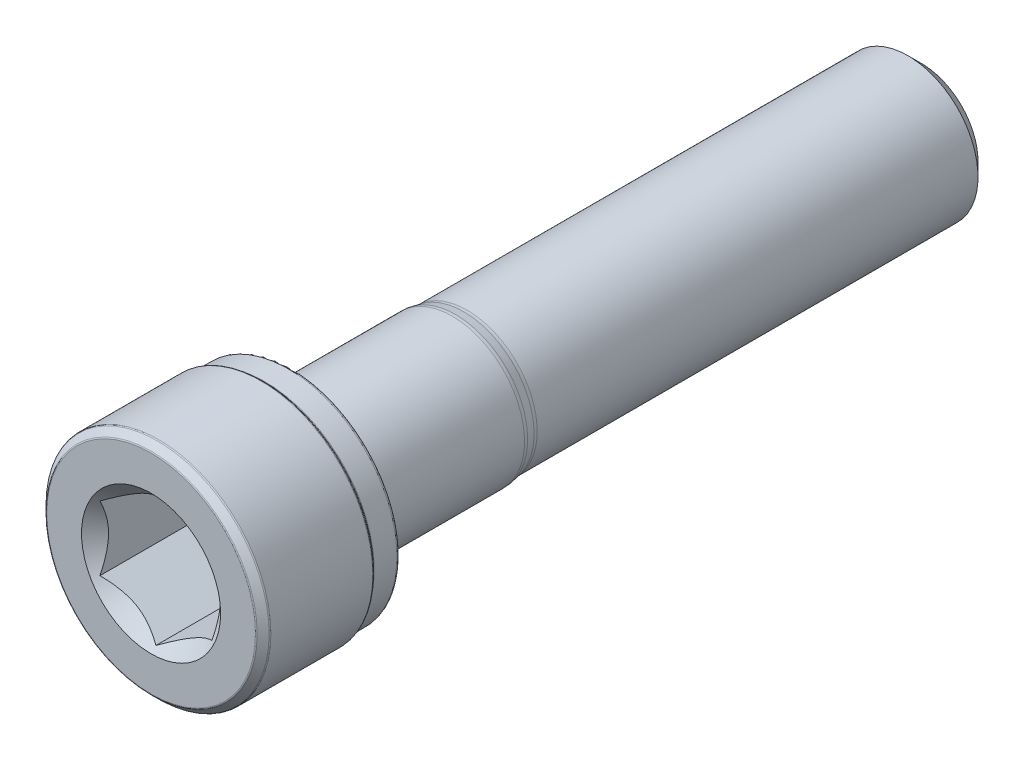
ISO-10303-21;
HEADER;
FILE_DESCRIPTION(('STEP AP214'),'2;1');
FILE_NAME('part.step','',(''),(''),'','','');
FILE_SCHEMA(('AUTOMOTIVE_DESIGN { 1 0 10303 214 1 1 1 1 }'));
ENDSEC;
DATA;
#1=APPLICATION_CONTEXT('core data for automotive mechanical design processes');
#2=APPLICATION_PROTOCOL_DEFINITION('international standard','automotive_design',2000,#1);
#3=PRODUCT_CONTEXT('',#1,'mechanical');
#4=PRODUCT('Part','Part','',(#3));
#5=PRODUCT_RELATED_PRODUCT_CATEGORY('part','',(#4));
#6=PRODUCT_DEFINITION_FORMATION('','',#4);
#7=PRODUCT_DEFINITION_CONTEXT('part definition',#1,'design');
#8=PRODUCT_DEFINITION('design','',#6,#7);
#9=PRODUCT_DEFINITION_SHAPE('','',#8);
#10=(LENGTH_UNIT() NAMED_UNIT(*) SI_UNIT(.MILLI.,.METRE.));
#11=(NAMED_UNIT(*) PLANE_ANGLE_UNIT() SI_UNIT($,.RADIAN.));
#12=(NAMED_UNIT(*) SI_UNIT($,.STERADIAN.) SOLID_ANGLE_UNIT());
#13=UNCERTAINTY_MEASURE_WITH_UNIT(LENGTH_MEASURE(1.E-05),#10,'distance_accuracy_value','');
#14=(GEOMETRIC_REPRESENTATION_CONTEXT(3) GLOBAL_UNCERTAINTY_ASSIGNED_CONTEXT((#13)) GLOBAL_UNIT_ASSIGNED_CONTEXT((#10,
#11,#12)) REPRESENTATION_CONTEXT('',''));
#15=CARTESIAN_POINT('',(0.,0.,0.));
#16=DIRECTION('',(0.,0.,1.));
#17=DIRECTION('',(1.,0.,0.));
#18=AXIS2_PLACEMENT_3D('',#15,#16,#17);
#19=CARTESIAN_POINT('',(0.,4.0257214207425,-27.5));
#20=DIRECTION('',(0.,0.,-1.));
#21=DIRECTION('',(-1.,0.,0.));
#22=AXIS2_PLACEMENT_3D('',#19,#20,#21);
#23=PLANE('',#22);
#24=CARTESIAN_POINT('',(0.,0.,-27.5));
#25=DIRECTION('',(0.,0.,-1.));
#26=DIRECTION('',(-1.,0.,0.));
#27=AXIS2_PLACEMENT_3D('',#24,#25,#26);
#28=CIRCLE('',#27,4.0257214207425);
#29=CARTESIAN_POINT('',(-4.0257214207425,0.,-27.5));
#30=VERTEX_POINT('',#29);
#31=EDGE_CURVE('E49',#30,#30,#28,.T.);
#32=ORIENTED_EDGE('',*,*,#31,.T.);
#33=EDGE_LOOP('',(#32));
#34=FACE_BOUND('',#33,.T.);
#35=ADVANCED_FACE('F36',(#34),#23,.T.);
#36=CARTESIAN_POINT('',(0.,0.,-27.5));
#37=DIRECTION('',(0.,0.,1.));
#38=DIRECTION('',(1.,0.,0.));
#39=AXIS2_PLACEMENT_3D('',#36,#37,#38);
#40=CONICAL_SURFACE('',#39,4.0257214207425,0.785398163397443);
#41=CARTESIAN_POINT('',(0.,0.,-26.5257214207425));
#42=DIRECTION('',(0.,0.,-1.));
#43=DIRECTION('',(-1.,0.,0.));
#44=AXIS2_PLACEMENT_3D('',#41,#42,#43);
#45=CIRCLE('',#44,5.);
#46=CARTESIAN_POINT('',(-5.,0.,-26.5257214207425));
#47=VERTEX_POINT('',#46);
#48=EDGE_CURVE('E182',#47,#47,#45,.T.);
#49=ORIENTED_EDGE('',*,*,#48,.T.);
#50=EDGE_LOOP('',(#49));
#51=FACE_BOUND('',#50,.T.);
#52=ORIENTED_EDGE('',*,*,#31,.F.);
#53=EDGE_LOOP('',(#52));
#54=FACE_BOUND('',#53,.T.);
#55=ADVANCED_FACE('F188',(#51,#54),#40,.T.);
#56=CARTESIAN_POINT('',(0.,0.,-27.5));
#57=DIRECTION('',(0.,0.,-1.));
#58=DIRECTION('',(-1.,0.,0.));
#59=AXIS2_PLACEMENT_3D('',#56,#57,#58);
#60=CYLINDRICAL_SURFACE('',#59,5.);
#61=CARTESIAN_POINT('',(0.,0.,4.93938574580355));
#62=DIRECTION('',(0.,0.,-1.));
#63=DIRECTION('',(-1.,0.,0.));
#64=AXIS2_PLACEMENT_3D('',#61,#62,#63);
#65=CIRCLE('',#64,5.);
#66=CARTESIAN_POINT('',(-5.,0.,4.93938574580355));
#67=VERTEX_POINT('',#66);
#68=EDGE_CURVE('E179',#67,#67,#65,.T.);
#69=ORIENTED_EDGE('',*,*,#68,.T.);
#70=EDGE_LOOP('',(#69));
#71=FACE_BOUND('',#70,.T.);
#72=ORIENTED_EDGE('',*,*,#48,.F.);
#73=EDGE_LOOP('',(#72));
#74=FACE_BOUND('',#73,.T.);
#75=ADVANCED_FACE('F190',(#71,#74),#60,.T.);
#76=CARTESIAN_POINT('',(0.,0.,4.93938574580355));
#77=DIRECTION('',(0.,0.,-1.));
#78=DIRECTION('',(-1.,0.,0.));
#79=AXIS2_PLACEMENT_3D('',#76,#77,#78);
#80=TOROIDAL_SURFACE('',#79,6.25,1.25);
#81=CARTESIAN_POINT('',(0.,0.,5.18324864832371));
#82=DIRECTION('',(0.,0.,-1.));
#83=DIRECTION('',(-1.,0.,0.));
#84=AXIS2_PLACEMENT_3D('',#81,#82,#83);
#85=CIRCLE('',#84,5.02401839949596);
#86=CARTESIAN_POINT('',(-5.02401839949596,0.,5.18324864832371));
#87=VERTEX_POINT('',#86);
#88=EDGE_CURVE('E176',#87,#87,#85,.T.);
#89=ORIENTED_EDGE('',*,*,#88,.T.);
#90=EDGE_LOOP('',(#89));
#91=FACE_BOUND('',#90,.T.);
#92=ORIENTED_EDGE('',*,*,#68,.F.);
#93=EDGE_LOOP('',(#92));
#94=FACE_BOUND('',#93,.T.);
#95=ADVANCED_FACE('F196',(#91,#94),#80,.F.);
#96=CARTESIAN_POINT('',(0.,0.,5.18324864832371));
#97=DIRECTION('',(0.,0.,1.));
#98=DIRECTION('',(1.,0.,0.));
#99=AXIS2_PLACEMENT_3D('',#96,#97,#98);
#100=CONICAL_SURFACE('',#99,5.02401839949596,0.196349540849362);
#101=CARTESIAN_POINT('',(0.,0.,5.75808954798184));
#102=DIRECTION('',(0.,0.,-1.));
#103=DIRECTION('',(-1.,0.,0.));
#104=AXIS2_PLACEMENT_3D('',#101,#102,#103);
#105=CIRCLE('',#104,5.13836136371362);
#106=CARTESIAN_POINT('',(-5.13836136371362,0.,5.75808954798184));
#107=VERTEX_POINT('',#106);
#108=EDGE_CURVE('E173',#107,#107,#105,.T.);
#109=ORIENTED_EDGE('',*,*,#108,.T.);
#110=EDGE_LOOP('',(#109));
#111=FACE_BOUND('',#110,.T.);
#112=ORIENTED_EDGE('',*,*,#88,.F.);
#113=EDGE_LOOP('',(#112));
#114=FACE_BOUND('',#113,.T.);
#115=ADVANCED_FACE('F202',(#111,#114),#100,.T.);
#116=CARTESIAN_POINT('',(0.,0.,6.00195245050201));
#117=DIRECTION('',(0.,0.,-1.));
#118=DIRECTION('',(-1.,0.,0.));
#119=AXIS2_PLACEMENT_3D('',#116,#117,#118);
#120=TOROIDAL_SURFACE('',#119,3.91237976320958,1.25);
#121=CARTESIAN_POINT('',(0.,0.,6.001952450502));
#122=DIRECTION('',(0.,0.,-1.));
#123=DIRECTION('',(-1.,0.,0.));
#124=AXIS2_PLACEMENT_3D('',#121,#122,#123);
#125=CIRCLE('',#124,5.16237976320958);
#126=CARTESIAN_POINT('',(-5.16237976320958,0.,6.001952450502));
#127=VERTEX_POINT('',#126);
#128=EDGE_CURVE('E170',#127,#127,#125,.T.);
#129=ORIENTED_EDGE('',*,*,#128,.T.);
#130=EDGE_LOOP('',(#129));
#131=FACE_BOUND('',#130,.T.);
#132=ORIENTED_EDGE('',*,*,#108,.F.);
#133=EDGE_LOOP('',(#132));
#134=FACE_BOUND('',#133,.T.);
#135=ADVANCED_FACE('F206',(#131,#134),#120,.T.);
#136=CARTESIAN_POINT('',(0.,0.,-27.5));
#137=DIRECTION('',(0.,0.,-1.));
#138=DIRECTION('',(-1.,0.,0.));
#139=AXIS2_PLACEMENT_3D('',#136,#137,#138);
#140=CYLINDRICAL_SURFACE('',#139,5.16237976320958);
#141=CARTESIAN_POINT('',(0.,0.,17.));
#142=DIRECTION('',(0.,0.,-1.));
#143=DIRECTION('',(-1.,0.,0.));
#144=AXIS2_PLACEMENT_3D('',#141,#142,#143);
#145=CIRCLE('',#144,5.16237976320958);
#146=CARTESIAN_POINT('',(-5.16237976320958,0.,17.));
#147=VERTEX_POINT('',#146);
#148=EDGE_CURVE('E167',#147,#147,#145,.T.);
#149=ORIENTED_EDGE('',*,*,#148,.T.);
#150=EDGE_LOOP('',(#149));
#151=FACE_BOUND('',#150,.T.);
#152=ORIENTED_EDGE('',*,*,#128,.F.);
#153=EDGE_LOOP('',(#152));
#154=FACE_BOUND('',#153,.T.);
#155=ADVANCED_FACE('F210',(#151,#154),#140,.T.);
#156=CARTESIAN_POINT('',(0.,0.,17.));
#157=DIRECTION('',(0.,0.,-1.));
#158=DIRECTION('',(-1.,0.,0.));
#159=AXIS2_PLACEMENT_3D('',#156,#157,#158);
#160=TOROIDAL_SURFACE('',#159,5.66237976320958,0.499999999999997);
#161=CARTESIAN_POINT('',(0.,0.,17.5));
#162=DIRECTION('',(0.,0.,-1.));
#163=DIRECTION('',(-1.,0.,0.));
#164=AXIS2_PLACEMENT_3D('',#161,#162,#163);
#165=CIRCLE('',#164,5.66237976320958);
#166=CARTESIAN_POINT('',(-5.66237976320958,0.,17.5));
#167=VERTEX_POINT('',#166);
#168=EDGE_CURVE('E164',#167,#167,#165,.T.);
#169=ORIENTED_EDGE('',*,*,#168,.T.);
#170=EDGE_LOOP('',(#169));
#171=FACE_BOUND('',#170,.T.);
#172=ORIENTED_EDGE('',*,*,#148,.F.);
#173=EDGE_LOOP('',(#172));
#174=FACE_BOUND('',#173,.T.);
#175=ADVANCED_FACE('F214',(#171,#174),#160,.F.);
#176=CARTESIAN_POINT('',(0.,7.55,17.5));
#177=DIRECTION('',(0.,0.,-1.));
#178=DIRECTION('',(-1.,0.,0.));
#179=AXIS2_PLACEMENT_3D('',#176,#177,#178);
#180=PLANE('',#179);
#181=CARTESIAN_POINT('',(0.,0.,17.5));
#182=DIRECTION('',(0.,0.,-1.));
#183=DIRECTION('',(-1.,0.,0.));
#184=AXIS2_PLACEMENT_3D('',#181,#182,#183);
#185=CIRCLE('',#184,7.55);
#186=CARTESIAN_POINT('',(-7.55,0.,17.5));
#187=VERTEX_POINT('',#186);
#188=EDGE_CURVE('E161',#187,#187,#185,.T.);
#189=ORIENTED_EDGE('',*,*,#188,.T.);
#190=EDGE_LOOP('',(#189));
#191=FACE_BOUND('',#190,.T.);
#192=ORIENTED_EDGE('',*,*,#168,.F.);
#193=EDGE_LOOP('',(#192));
#194=FACE_BOUND('',#193,.T.);
#195=ADVANCED_FACE('F218',(#191,#194),#180,.T.);
#196=CARTESIAN_POINT('',(0.,0.,17.7));
#197=DIRECTION('',(0.,0.,-1.));
#198=DIRECTION('',(-1.,0.,0.));
#199=AXIS2_PLACEMENT_3D('',#196,#197,#198);
#200=TOROIDAL_SURFACE('',#199,7.55,0.199999999999999);
#201=CARTESIAN_POINT('',(0.,0.,17.7));
#202=DIRECTION('',(0.,0.,-1.));
#203=DIRECTION('',(-1.,0.,0.));
#204=AXIS2_PLACEMENT_3D('',#201,#202,#203);
#205=CIRCLE('',#204,7.75);
#206=CARTESIAN_POINT('',(-7.75,0.,17.7));
#207=VERTEX_POINT('',#206);
#208=EDGE_CURVE('E158',#207,#207,#205,.T.);
#209=ORIENTED_EDGE('',*,*,#208,.T.);
#210=EDGE_LOOP('',(#209));
#211=FACE_BOUND('',#210,.T.);
#212=ORIENTED_EDGE('',*,*,#188,.F.);
#213=EDGE_LOOP('',(#212));
#214=FACE_BOUND('',#213,.T.);
#215=ADVANCED_FACE('F222',(#211,#214),#200,.T.);
#216=CARTESIAN_POINT('',(0.,0.,-27.5));
#217=DIRECTION('',(0.,0.,-1.));
#218=DIRECTION('',(-1.,0.,0.));
#219=AXIS2_PLACEMENT_3D('',#216,#217,#218);
#220=CYLINDRICAL_SURFACE('',#219,7.75);
#221=CARTESIAN_POINT('',(0.,0.,19.3232233047034));
#222=DIRECTION('',(0.,0.,-1.));
#223=DIRECTION('',(-1.,0.,0.));
#224=AXIS2_PLACEMENT_3D('',#221,#222,#223);
#225=CIRCLE('',#224,7.75);
#226=CARTESIAN_POINT('',(-7.75,0.,19.3232233047034));
#227=VERTEX_POINT('',#226);
#228=EDGE_CURVE('E155',#227,#227,#225,.T.);
#229=ORIENTED_EDGE('',*,*,#228,.T.);
#230=EDGE_LOOP('',(#229));
#231=FACE_BOUND('',#230,.T.);
#232=ORIENTED_EDGE('',*,*,#208,.F.);
#233=EDGE_LOOP('',(#232));
#234=FACE_BOUND('',#233,.T.);
#235=ADVANCED_FACE('F226',(#231,#234),#220,.T.);
#236=CARTESIAN_POINT('',(0.,0.,19.3232233047034));
#237=DIRECTION('',(0.,0.,-1.));
#238=DIRECTION('',(-1.,0.,0.));
#239=AXIS2_PLACEMENT_3D('',#236,#237,#238);
#240=TOROIDAL_SURFACE('',#239,7.875,0.125000000000001);
#241=CARTESIAN_POINT('',(0.,0.,19.4116116523517));
#242=DIRECTION('',(0.,0.,-1.));
#243=DIRECTION('',(-1.,0.,0.));
#244=AXIS2_PLACEMENT_3D('',#241,#242,#243);
#245=CIRCLE('',#244,7.78661165235168);
#246=CARTESIAN_POINT('',(-7.78661165235168,0.,19.4116116523517));
#247=VERTEX_POINT('',#246);
#248=EDGE_CURVE('E152',#247,#247,#245,.T.);
#249=ORIENTED_EDGE('',*,*,#248,.T.);
#250=EDGE_LOOP('',(#249));
#251=FACE_BOUND('',#250,.T.);
#252=ORIENTED_EDGE('',*,*,#228,.F.);
#253=EDGE_LOOP('',(#252));
#254=FACE_BOUND('',#253,.T.);
#255=ADVANCED_FACE('F230',(#251,#254),#240,.F.);
#256=CARTESIAN_POINT('',(0.,0.,19.4116116523517));
#257=DIRECTION('',(0.,0.,1.));
#258=DIRECTION('',(1.,0.,0.));
#259=AXIS2_PLACEMENT_3D('',#256,#257,#258);
#260=CONICAL_SURFACE('',#259,7.78661165235168,0.785398163397461);
#261=CARTESIAN_POINT('',(0.,0.,19.5883883476483));
#262=DIRECTION('',(0.,0.,-1.));
#263=DIRECTION('',(-1.,0.,0.));
#264=AXIS2_PLACEMENT_3D('',#261,#262,#263);
#265=CIRCLE('',#264,7.96338834764832);
#266=CARTESIAN_POINT('',(-7.96338834764832,0.,19.5883883476483));
#267=VERTEX_POINT('',#266);
#268=EDGE_CURVE('E149',#267,#267,#265,.T.);
#269=ORIENTED_EDGE('',*,*,#268,.T.);
#270=EDGE_LOOP('',(#269));
#271=FACE_BOUND('',#270,.T.);
#272=ORIENTED_EDGE('',*,*,#248,.F.);
#273=EDGE_LOOP('',(#272));
#274=FACE_BOUND('',#273,.T.);
#275=ADVANCED_FACE('F234',(#271,#274),#260,.T.);
#276=CARTESIAN_POINT('',(0.,0.,19.6767766952966));
#277=DIRECTION('',(0.,0.,-1.));
#278=DIRECTION('',(-1.,0.,0.));
#279=AXIS2_PLACEMENT_3D('',#276,#277,#278);
#280=TOROIDAL_SURFACE('',#279,7.875,0.125000000000001);
#281=CARTESIAN_POINT('',(0.,0.,19.6767766952966));
#282=DIRECTION('',(0.,0.,-1.));
#283=DIRECTION('',(-1.,0.,0.));
#284=AXIS2_PLACEMENT_3D('',#281,#282,#283);
#285=CIRCLE('',#284,8.);
#286=CARTESIAN_POINT('',(-8.,0.,19.6767766952966));
#287=VERTEX_POINT('',#286);
#288=EDGE_CURVE('E146',#287,#287,#285,.T.);
#289=ORIENTED_EDGE('',*,*,#288,.T.);
#290=EDGE_LOOP('',(#289));
#291=FACE_BOUND('',#290,.T.);
#292=ORIENTED_EDGE('',*,*,#268,.F.);
#293=EDGE_LOOP('',(#292));
#294=FACE_BOUND('',#293,.T.);
#295=ADVANCED_FACE('F238',(#291,#294),#280,.T.);
#296=CARTESIAN_POINT('',(0.,0.,-27.5));
#297=DIRECTION('',(0.,0.,-1.));
#298=DIRECTION('',(-1.,0.,0.));
#299=AXIS2_PLACEMENT_3D('',#296,#297,#298);
#300=CYLINDRICAL_SURFACE('',#299,8.);
#301=CARTESIAN_POINT('',(0.,0.,26.9482233047034));
#302=DIRECTION('',(0.,0.,-1.));
#303=DIRECTION('',(-1.,0.,0.));
#304=AXIS2_PLACEMENT_3D('',#301,#302,#303);
#305=CIRCLE('',#304,8.);
#306=CARTESIAN_POINT('',(-8.,0.,26.9482233047034));
#307=VERTEX_POINT('',#306);
#308=EDGE_CURVE('E143',#307,#307,#305,.T.);
#309=ORIENTED_EDGE('',*,*,#308,.T.);
#310=EDGE_LOOP('',(#309));
#311=FACE_BOUND('',#310,.T.);
#312=ORIENTED_EDGE('',*,*,#288,.F.);
#313=EDGE_LOOP('',(#312));
#314=FACE_BOUND('',#313,.T.);
#315=ADVANCED_FACE('F242',(#311,#314),#300,.T.);
#316=CARTESIAN_POINT('',(0.,0.,26.9482233047034));
#317=DIRECTION('',(0.,0.,-1.));
#318=DIRECTION('',(-1.,0.,0.));
#319=AXIS2_PLACEMENT_3D('',#316,#317,#318);
#320=TOROIDAL_SURFACE('',#319,7.875,0.125000000000002);
#321=CARTESIAN_POINT('',(0.,0.,27.0366116523517));
#322=DIRECTION('',(0.,0.,-1.));
#323=DIRECTION('',(-1.,0.,0.));
#324=AXIS2_PLACEMENT_3D('',#321,#322,#323);
#325=CIRCLE('',#324,7.96338834764832);
#326=CARTESIAN_POINT('',(-7.96338834764832,0.,27.0366116523517));
#327=VERTEX_POINT('',#326);
#328=EDGE_CURVE('E140',#327,#327,#325,.T.);
#329=ORIENTED_EDGE('',*,*,#328,.T.);
#330=EDGE_LOOP('',(#329));
#331=FACE_BOUND('',#330,.T.);
#332=ORIENTED_EDGE('',*,*,#308,.F.);
#333=EDGE_LOOP('',(#332));
#334=FACE_BOUND('',#333,.T.);
#335=ADVANCED_FACE('F246',(#331,#334),#320,.T.);
#336=CARTESIAN_POINT('',(0.,0.,27.0366116523517));
#337=DIRECTION('',(0.,0.,-1.));
#338=DIRECTION('',(-1.,0.,0.));
#339=AXIS2_PLACEMENT_3D('',#336,#337,#338);
#340=CONICAL_SURFACE('',#339,7.96338834764832,0.785398163397458);
#341=CARTESIAN_POINT('',(0.,0.,27.4633883476483));
#342=DIRECTION('',(0.,0.,-1.));
#343=DIRECTION('',(-1.,0.,0.));
#344=AXIS2_PLACEMENT_3D('',#341,#342,#343);
#345=CIRCLE('',#344,7.53661165235168);
#346=CARTESIAN_POINT('',(-7.53661165235168,0.,27.4633883476483));
#347=VERTEX_POINT('',#346);
#348=EDGE_CURVE('E137',#347,#347,#345,.T.);
#349=ORIENTED_EDGE('',*,*,#348,.T.);
#350=EDGE_LOOP('',(#349));
#351=FACE_BOUND('',#350,.T.);
#352=ORIENTED_EDGE('',*,*,#328,.F.);
#353=EDGE_LOOP('',(#352));
#354=FACE_BOUND('',#353,.T.);
#355=ADVANCED_FACE('F250',(#351,#354),#340,.T.);
#356=CARTESIAN_POINT('',(0.,0.,27.375));
#357=DIRECTION('',(0.,0.,-1.));
#358=DIRECTION('',(-1.,0.,0.));
#359=AXIS2_PLACEMENT_3D('',#356,#357,#358);
#360=TOROIDAL_SURFACE('',#359,7.44822330470336,0.125);
#361=CARTESIAN_POINT('',(0.,0.,27.5));
#362=DIRECTION('',(0.,0.,-1.));
#363=DIRECTION('',(-1.,0.,0.));
#364=AXIS2_PLACEMENT_3D('',#361,#362,#363);
#365=CIRCLE('',#364,7.44822330470336);
#366=CARTESIAN_POINT('',(-7.44822330470336,0.,27.5));
#367=VERTEX_POINT('',#366);
#368=EDGE_CURVE('E134',#367,#367,#365,.T.);
#369=ORIENTED_EDGE('',*,*,#368,.T.);
#370=EDGE_LOOP('',(#369));
#371=FACE_BOUND('',#370,.T.);
#372=ORIENTED_EDGE('',*,*,#348,.F.);
#373=EDGE_LOOP('',(#372));
#374=FACE_BOUND('',#373,.T.);
#375=ADVANCED_FACE('F254',(#371,#374),#360,.T.);
#376=CARTESIAN_POINT('',(0.,0.,27.5));
#377=DIRECTION('',(0.,0.,1.));
#378=DIRECTION('',(1.,0.,0.));
#379=AXIS2_PLACEMENT_3D('',#376,#377,#378);
#380=PLANE('',#379);
#381=CARTESIAN_POINT('',(0.,0.,27.5));
#382=DIRECTION('',(0.,0.,1.));
#383=DIRECTION('',(1.,0.,0.));
#384=AXIS2_PLACEMENT_3D('',#381,#382,#383);
#385=CIRCLE('',#384,4.96521231503078);
#386=CARTESIAN_POINT('',(4.96521231503078,0.,27.5));
#387=VERTEX_POINT('',#386);
#388=EDGE_CURVE('E108',#387,#387,#385,.T.);
#389=ORIENTED_EDGE('',*,*,#388,.F.);
#390=EDGE_LOOP('',(#389));
#391=FACE_BOUND('',#390,.T.);
#392=ORIENTED_EDGE('',*,*,#368,.F.);
#393=EDGE_LOOP('',(#392));
#394=FACE_BOUND('',#393,.T.);
#395=ADVANCED_FACE('F258',(#391,#394),#380,.T.);
#396=CARTESIAN_POINT('',(0.,0.,27.5));
#397=DIRECTION('',(0.,0.,1.));
#398=DIRECTION('',(1.,0.,0.));
#399=AXIS2_PLACEMENT_3D('',#396,#397,#398);
#400=CONICAL_SURFACE('',#399,4.96521231503078,0.78539816339745);
#401=ORIENTED_EDGE('',*,*,#388,.T.);
#402=EDGE_LOOP('',(#401));
#403=FACE_BOUND('',#402,.T.);
#404=CARTESIAN_POINT('',(-0.000199999999999184,-4.61891762357084,27.1537053128701));
#405=CARTESIAN_POINT('',(0.0685809847183843,-4.57920690352856,27.1139986944438));
#406=CARTESIAN_POINT('',(0.137888304896503,-4.53919230356691,27.0755102555994));
#407=CARTESIAN_POINT('',(0.277664036763595,-4.45849274714727,27.0013410622217));
#408=CARTESIAN_POINT('',(0.348133057578706,-4.41780743901013,26.9656618412179));
#409=CARTESIAN_POINT('',(0.562100081603905,-4.29427352009148,26.8630907061372));
#410=CARTESIAN_POINT('',(0.707416589267749,-4.21037499527406,26.8011029494988));
#411=CARTESIAN_POINT('',(1.00040214981326,-4.04121970302444,26.6949457074956));
#412=CARTESIAN_POINT('',(1.14799719663765,-3.95600566300932,26.6505088939397));
#413=CARTESIAN_POINT('',(1.44644641508887,-3.78369592639707,26.5820388206157));
#414=CARTESIAN_POINT('',(1.59729144640344,-3.69660550696169,26.5579544763475));
#415=CARTESIAN_POINT('',(1.85726690511357,-3.5465086058927,26.5362247193468));
#416=CARTESIAN_POINT('',(1.96606238220553,-3.48369550790704,26.5330087531271));
#417=CARTESIAN_POINT('',(2.18347675426334,-3.35817126167378,26.5384298967112));
#418=CARTESIAN_POINT('',(2.29209557396636,-3.29546015687917,26.547071161658));
#419=CARTESIAN_POINT('',(2.50830402737816,-3.1706321481008,26.5757138769827));
#420=CARTESIAN_POINT('',(2.61589237292034,-3.10851598784036,26.5957280330375));
#421=CARTESIAN_POINT('',(2.82922129322135,-2.98535047827863,26.6460239958509));
#422=CARTESIAN_POINT('',(2.93496200899965,-2.92430104755973,26.6763050153646));
#423=CARTESIAN_POINT('',(3.12267722089177,-2.81592361944283,26.7386050911804));
#424=CARTESIAN_POINT('',(3.20506731843131,-2.76835567444981,26.7689861183463));
#425=CARTESIAN_POINT('',(3.3683684620413,-2.67407371522761,26.8346443030466));
#426=CARTESIAN_POINT('',(3.44927946303277,-2.62735972702479,26.869921609526));
#427=CARTESIAN_POINT('',(3.60936749601014,-2.53493285809126,26.9445815255071));
#428=CARTESIAN_POINT('',(3.68854908118624,-2.48921734857498,26.9839512254898));
#429=CARTESIAN_POINT('',(3.84544590098815,-2.39863292742735,27.0662789466295));
#430=CARTESIAN_POINT('',(3.92316199986077,-2.35376351682288,27.1092347662882));
#431=CARTESIAN_POINT('',(4.0002,-2.30928560670466,27.1537053128701));
#432=B_SPLINE_CURVE_WITH_KNOTS('',3,(#404,#405,#406,#407,#408,#409,#410,#411,#412,#413,#414,
#415,#416,#417,#418,#419,#420,#421,#422,#423,#424,#425,#426,#427,#428,#429,#430,#431),
.UNSPECIFIED.,.F.,.F.,(4,2,2,2,2,2,2,2,2,2,2,2,2,4),(0.,0.266361961703665,0.532868334400113,
1.06875865685462,1.59613884594051,2.12219135055581,2.49866160599659,2.87526382203495,
3.25228760372077,3.62928248242858,3.92874944437161,4.22822551811345,4.52678401907573,
4.82516056577922),.UNSPECIFIED.);
#433=CARTESIAN_POINT('',(0.,-4.618802153517,27.1535898384862));
#434=VERTEX_POINT('',#433);
#435=CARTESIAN_POINT('',(4.,-2.3094010767585,27.1535898384862));
#436=VERTEX_POINT('',#435);
#437=EDGE_CURVE('E13',#434,#436,#432,.T.);
#438=ORIENTED_EDGE('',*,*,#437,.F.);
#439=CARTESIAN_POINT('',(-4.0002,-2.30928560670466,27.1537053128701));
#440=CARTESIAN_POINT('',(-3.93141901528161,-2.34899632674695,27.1139986944438));
#441=CARTESIAN_POINT('',(-3.8621116951035,-2.3890109267086,27.0755102555994));
#442=CARTESIAN_POINT('',(-3.7223359632364,-2.46971048312824,27.0013410622217));
#443=CARTESIAN_POINT('',(-3.65186694242129,-2.51039579126538,26.9656618412179));
#444=CARTESIAN_POINT('',(-3.43789991839609,-2.63392971018403,26.8630907061372));
#445=CARTESIAN_POINT('',(-3.29258341073225,-2.71782823500144,26.8011029494988));
#446=CARTESIAN_POINT('',(-2.99959785018674,-2.88698352725107,26.6949457074956));
#447=CARTESIAN_POINT('',(-2.85200280336235,-2.97219756726618,26.6505088939397));
#448=CARTESIAN_POINT('',(-2.55355358491113,-3.14450730387843,26.5820388206157));
#449=CARTESIAN_POINT('',(-2.40270855359656,-3.23159772331381,26.5579544763475));
#450=CARTESIAN_POINT('',(-2.14273309488644,-3.3816946243828,26.5362247193467));
#451=CARTESIAN_POINT('',(-2.03393761779447,-3.44450772236846,26.5330087531271));
#452=CARTESIAN_POINT('',(-1.81652324573667,-3.57003196860173,26.5384298967112));
#453=CARTESIAN_POINT('',(-1.70790442603364,-3.63274307339633,26.547071161658));
#454=CARTESIAN_POINT('',(-1.49169597262184,-3.7575710821747,26.5757138769827));
#455=CARTESIAN_POINT('',(-1.38410762707966,-3.81968724243515,26.5957280330375));
#456=CARTESIAN_POINT('',(-1.17077870677865,-3.94285275199687,26.6460239958509));
#457=CARTESIAN_POINT('',(-1.06503799100035,-4.00390218271577,26.6763050153646));
#458=CARTESIAN_POINT('',(-0.877322779108236,-4.11227961083267,26.7386050911804));
#459=CARTESIAN_POINT('',(-0.794932681568686,-4.15984755582569,26.7689861183463));
#460=CARTESIAN_POINT('',(-0.631631537958703,-4.25412951504789,26.8346443030466));
#461=CARTESIAN_POINT('',(-0.550720536967236,-4.30084350325072,26.869921609526));
#462=CARTESIAN_POINT('',(-0.390632503989867,-4.39327037218424,26.9445815255071));
#463=CARTESIAN_POINT('',(-0.311450918813762,-4.43898588170052,26.9839512254898));
#464=CARTESIAN_POINT('',(-0.154554099011846,-4.52957030284816,27.0662789466295));
#465=CARTESIAN_POINT('',(-0.0768380001392359,-4.57443971345262,27.1092347662882));
#466=CARTESIAN_POINT('',(0.000199999999999298,-4.61891762357084,27.1537053128701));
#467=B_SPLINE_CURVE_WITH_KNOTS('',3,(#439,#440,#441,#442,#443,#444,#445,#446,#447,#448,#449,
#450,#451,#452,#453,#454,#455,#456,#457,#458,#459,#460,#461,#462,#463,#464,#465,#466),
.UNSPECIFIED.,.F.,.F.,(4,2,2,2,2,2,2,2,2,2,2,2,2,4),(0.,0.266361961703663,0.532868334400111,
1.06875865685462,1.59613884594051,2.1221913505558,2.49866160599658,2.87526382203494,
3.25228760372076,3.62928248242857,3.92874944437161,4.22822551811344,4.52678401907573,
4.82516056577921),.UNSPECIFIED.);
#468=CARTESIAN_POINT('',(-4.,-2.3094010767585,27.1535898384862));
#469=VERTEX_POINT('',#468);
#470=EDGE_CURVE('E94',#469,#434,#467,.T.);
#471=ORIENTED_EDGE('',*,*,#470,.F.);
#472=CARTESIAN_POINT('',(-4.,-4.84796351159736,28.8199090210915));
#473=CARTESIAN_POINT('',(-4.,-4.73094775271701,28.7296703519537));
#474=CARTESIAN_POINT('',(-4.,-4.61330473327711,28.6402323513585));
#475=CARTESIAN_POINT('',(-4.,-4.37650663932726,28.463324424178));
#476=CARTESIAN_POINT('',(-4.,-4.25735121633365,28.3758549645429));
#477=CARTESIAN_POINT('',(-4.,-4.01640038536639,28.202628492792));
#478=CARTESIAN_POINT('',(-4.,-3.89459170738759,28.1168898786441));
#479=CARTESIAN_POINT('',(-4.,-3.64895271240305,27.9483692995862));
#480=CARTESIAN_POINT('',(-4.,-3.52512253503683,27.865587131702));
#481=CARTESIAN_POINT('',(-4.,-3.26706602333273,27.6984528333312));
#482=CARTESIAN_POINT('',(-4.,-3.13268291093558,27.6143415566521));
#483=CARTESIAN_POINT('',(-4.,-2.86075911194824,27.45130040367));
#484=CARTESIAN_POINT('',(-4.,-2.72321789522222,27.3723714060017));
#485=CARTESIAN_POINT('',(-4.,-2.44493368555139,27.2213727282298));
#486=CARTESIAN_POINT('',(-4.,-2.30420169961261,27.1492829212728));
#487=CARTESIAN_POINT('',(-4.,-2.01874172826489,27.0135778764669));
#488=CARTESIAN_POINT('',(-4.,-1.87401567716766,26.9499586203861));
#489=CARTESIAN_POINT('',(-4.,-1.59506570153393,26.8393837995044));
#490=CARTESIAN_POINT('',(-4.,-1.46125573687274,26.791394523732));
#491=CARTESIAN_POINT('',(-4.,-1.19020243591671,26.7061242743582));
#492=CARTESIAN_POINT('',(-4.,-1.0529588836101,26.6688439763244));
#493=CARTESIAN_POINT('',(-4.,-0.77826306033359,26.607641052654));
#494=CARTESIAN_POINT('',(-4.,-0.640866189889941,26.5834739691558));
#495=CARTESIAN_POINT('',(-4.,-0.364334338536459,26.5490058458618));
#496=CARTESIAN_POINT('',(-4.,-0.225199733425797,26.5387018587228));
#497=CARTESIAN_POINT('',(-4.,0.0471484323145581,26.5328522686027));
#498=CARTESIAN_POINT('',(-4.,0.180348358873335,26.5366669151268));
#499=CARTESIAN_POINT('',(-4.,0.445721460208563,26.5573687741345));
#500=CARTESIAN_POINT('',(-4.,0.577894541582717,26.5742571620696));
#501=CARTESIAN_POINT('',(-4.,0.842498402684408,26.6204342043486));
#502=CARTESIAN_POINT('',(-4.,0.974890129436142,26.6499428512439));
#503=CARTESIAN_POINT('',(-4.,1.23675344348026,26.7197148848402));
#504=CARTESIAN_POINT('',(-4.,1.36622518545985,26.7599777003772));
#505=CARTESIAN_POINT('',(-4.,1.62882923254182,26.8518636882929));
#506=CARTESIAN_POINT('',(-4.,1.7617873246249,26.9039790323119));
#507=CARTESIAN_POINT('',(-4.,2.02428699372346,27.0162662972943));
#508=CARTESIAN_POINT('',(-4.,2.15382700464209,27.0764418371076));
#509=CARTESIAN_POINT('',(-4.,2.41009996466026,27.2034228472037));
#510=CARTESIAN_POINT('',(-4.,2.53682273673023,27.2702486898914));
#511=CARTESIAN_POINT('',(-4.,2.78736578127709,27.4090604627306));
#512=CARTESIAN_POINT('',(-4.,2.9111864951555,27.4810456013078));
#513=CARTESIAN_POINT('',(-4.,3.15025630477812,27.6255146350887));
#514=CARTESIAN_POINT('',(-4.,3.26562685587696,27.6977986060776));
#515=CARTESIAN_POINT('',(-4.,3.49438568289111,27.8454470624286));
#516=CARTESIAN_POINT('',(-4.,3.60777380947017,27.9208117784483));
#517=CARTESIAN_POINT('',(-4.,3.83191643601812,28.0734599586493));
#518=CARTESIAN_POINT('',(-4.,3.94268476297645,28.1507231928381));
#519=CARTESIAN_POINT('',(-4.,4.16270125868065,28.3073236511593));
#520=CARTESIAN_POINT('',(-4.,4.27194983812314,28.3866602976074));
#521=CARTESIAN_POINT('',(-4.,4.38056079245562,28.4668457474294));
#522=B_SPLINE_CURVE_WITH_KNOTS('',3,(#472,#473,#474,#475,#476,#477,#478,#479,#480,#481,#482,
#483,#484,#485,#486,#487,#488,#489,#490,#491,#492,#493,#494,#495,#496,#497,#498,#499,#500,#501,
#502,#503,#504,#505,#506,#507,#508,#509,#510,#511,#512,#513,#514,#515,#516,#517,#518,#519,#520,
#521),.UNSPECIFIED.,.F.,.F.,(4,2,2,2,2,2,2,2,2,2,2,2,2,2,2,2,2,2,2,2,2,2,2,2,4),(0.,
0.443315334200679,0.886734740254649,1.33357225144677,1.78037902588288,2.25589283704767,
2.73148706259438,3.20563518661489,3.67955757830237,4.10565623427866,4.53178176445625,
4.94966371534264,5.36745680900746,5.76655525660627,6.16568959105216,6.57208484515973,
6.97845851952618,7.40655214722653,7.83483862783029,8.26448005031805,8.69405569483094,
9.10243198754726,9.51083891188531,9.91597117746563,10.3209917457071),.UNSPECIFIED.);
#523=CARTESIAN_POINT('',(-4.,2.3094010767585,27.1535898384862));
#524=VERTEX_POINT('',#523);
#525=EDGE_CURVE('E107',#524,#469,#522,.F.);
#526=ORIENTED_EDGE('',*,*,#525,.F.);
#527=CARTESIAN_POINT('',(0.000199999999999067,4.61891762357084,27.1537053128701));
#528=CARTESIAN_POINT('',(-0.0685809847183844,4.57920690352855,27.1139986944438));
#529=CARTESIAN_POINT('',(-0.137888304896503,4.53919230356691,27.0755102555994));
#530=CARTESIAN_POINT('',(-0.277664036763595,4.45849274714726,27.0013410622217));
#531=CARTESIAN_POINT('',(-0.348133057578706,4.41780743901013,26.9656618412179));
#532=CARTESIAN_POINT('',(-0.562100081603903,4.29427352009148,26.8630907061372));
#533=CARTESIAN_POINT('',(-0.707416589267747,4.21037499527406,26.8011029494988));
#534=CARTESIAN_POINT('',(-1.00040214981326,4.04121970302444,26.6949457074956));
#535=CARTESIAN_POINT('',(-1.14799719663765,3.95600566300932,26.6505088939397));
#536=CARTESIAN_POINT('',(-1.44644641508887,3.78369592639707,26.5820388206157));
#537=CARTESIAN_POINT('',(-1.59729144640344,3.69660550696169,26.5579544763475));
#538=CARTESIAN_POINT('',(-1.85726690511356,3.54650860589271,26.5362247193467));
#539=CARTESIAN_POINT('',(-1.96606238220553,3.48369550790704,26.5330087531271));
#540=CARTESIAN_POINT('',(-2.18347675426333,3.35817126167378,26.5384298967112));
#541=CARTESIAN_POINT('',(-2.29209557396636,3.29546015687918,26.5470711616581));
#542=CARTESIAN_POINT('',(-2.50830402737816,3.1706321481008,26.5757138769827));
#543=CARTESIAN_POINT('',(-2.61589237292034,3.10851598784036,26.5957280330375));
#544=CARTESIAN_POINT('',(-2.82922129322135,2.98535047827864,26.6460239958509));
#545=CARTESIAN_POINT('',(-2.93496200899964,2.92430104755973,26.6763050153646));
#546=CARTESIAN_POINT('',(-3.12267722089176,2.81592361944283,26.7386050911804));
#547=CARTESIAN_POINT('',(-3.20506731843131,2.76835567444981,26.7689861183463));
#548=CARTESIAN_POINT('',(-3.3683684620413,2.67407371522761,26.8346443030466));
#549=CARTESIAN_POINT('',(-3.44927946303276,2.62735972702479,26.869921609526));
#550=CARTESIAN_POINT('',(-3.60936749601013,2.53493285809127,26.9445815255071));
#551=CARTESIAN_POINT('',(-3.68854908118624,2.48921734857498,26.9839512254898));
#552=CARTESIAN_POINT('',(-3.84544590098815,2.39863292742735,27.0662789466295));
#553=CARTESIAN_POINT('',(-3.92316199986076,2.35376351682288,27.1092347662882));
#554=CARTESIAN_POINT('',(-4.0002,2.30928560670466,27.1537053128701));
#555=B_SPLINE_CURVE_WITH_KNOTS('',3,(#527,#528,#529,#530,#531,#532,#533,#534,#535,#536,#537,
#538,#539,#540,#541,#542,#543,#544,#545,#546,#547,#548,#549,#550,#551,#552,#553,#554),
.UNSPECIFIED.,.F.,.F.,(4,2,2,2,2,2,2,2,2,2,2,2,2,4),(0.,0.266361961703663,0.532868334400111,
1.06875865685462,1.59613884594051,2.1221913505558,2.49866160599658,2.87526382203494,
3.25228760372076,3.62928248242857,3.92874944437161,4.22822551811345,4.52678401907573,
4.82516056577921),.UNSPECIFIED.);
#556=CARTESIAN_POINT('',(0.,4.618802153517,27.1535898384862));
#557=VERTEX_POINT('',#556);
#558=EDGE_CURVE('E308',#557,#524,#555,.T.);
#559=ORIENTED_EDGE('',*,*,#558,.F.);
#560=CARTESIAN_POINT('',(4.0002,2.30928560670466,27.1537053128701));
#561=CARTESIAN_POINT('',(3.93141901528162,2.34899632674695,27.1139986944438));
#562=CARTESIAN_POINT('',(3.8621116951035,2.3890109267086,27.0755102555994));
#563=CARTESIAN_POINT('',(3.72233596323641,2.46971048312824,27.0013410622217));
#564=CARTESIAN_POINT('',(3.65186694242129,2.51039579126537,26.9656618412179));
#565=CARTESIAN_POINT('',(3.4378999183961,2.63392971018402,26.8630907061372));
#566=CARTESIAN_POINT('',(3.29258341073225,2.71782823500144,26.8011029494988));
#567=CARTESIAN_POINT('',(2.99959785018674,2.88698352725106,26.6949457074956));
#568=CARTESIAN_POINT('',(2.85200280336235,2.97219756726618,26.6505088939397));
#569=CARTESIAN_POINT('',(2.55355358491113,3.14450730387843,26.5820388206157));
#570=CARTESIAN_POINT('',(2.40270855359656,3.23159772331381,26.5579544763475));
#571=CARTESIAN_POINT('',(2.14273309488644,3.3816946243828,26.5362247193467));
#572=CARTESIAN_POINT('',(2.03393761779447,3.44450772236846,26.5330087531271));
#573=CARTESIAN_POINT('',(1.81652324573667,3.57003196860173,26.5384298967112));
#574=CARTESIAN_POINT('',(1.70790442603364,3.63274307339633,26.547071161658));
#575=CARTESIAN_POINT('',(1.49169597262184,3.7575710821747,26.5757138769827));
#576=CARTESIAN_POINT('',(1.38410762707966,3.81968724243515,26.5957280330375));
#577=CARTESIAN_POINT('',(1.17077870677865,3.94285275199687,26.6460239958509));
#578=CARTESIAN_POINT('',(1.06503799100035,4.00390218271577,26.6763050153646));
#579=CARTESIAN_POINT('',(0.877322779108235,4.11227961083267,26.7386050911804));
#580=CARTESIAN_POINT('',(0.794932681568687,4.15984755582569,26.7689861183463));
#581=CARTESIAN_POINT('',(0.631631537958703,4.25412951504789,26.8346443030466));
#582=CARTESIAN_POINT('',(0.550720536967234,4.30084350325072,26.869921609526));
#583=CARTESIAN_POINT('',(0.390632503989863,4.39327037218424,26.9445815255071));
#584=CARTESIAN_POINT('',(0.311450918813759,4.43898588170052,26.9839512254898));
#585=CARTESIAN_POINT('',(0.154554099011843,4.52957030284816,27.0662789466295));
#586=CARTESIAN_POINT('',(0.076838000139234,4.57443971345262,27.1092347662882));
#587=CARTESIAN_POINT('',(-0.000200000000001106,4.61891762357084,27.1537053128701));
#588=B_SPLINE_CURVE_WITH_KNOTS('',3,(#560,#561,#562,#563,#564,#565,#566,#567,#568,#569,#570,
#571,#572,#573,#574,#575,#576,#577,#578,#579,#580,#581,#582,#583,#584,#585,#586,#587),
.UNSPECIFIED.,.F.,.F.,(4,2,2,2,2,2,2,2,2,2,2,2,2,4),(0.,0.266361961703665,0.532868334400113,
1.06875865685462,1.59613884594051,2.1221913505558,2.49866160599658,2.87526382203494,
3.25228760372077,3.62928248242858,3.92874944437161,4.22822551811345,4.52678401907574,
4.82516056577921),.UNSPECIFIED.);
#589=CARTESIAN_POINT('',(4.,2.3094010767585,27.1535898384862));
#590=VERTEX_POINT('',#589);
#591=EDGE_CURVE('E281',#590,#557,#588,.T.);
#592=ORIENTED_EDGE('',*,*,#591,.F.);
#593=CARTESIAN_POINT('',(4.,-4.84796351159735,28.8199090210915));
#594=CARTESIAN_POINT('',(4.,-4.730947752717,28.7296703519537));
#595=CARTESIAN_POINT('',(4.,-4.61330473327711,28.6402323513585));
#596=CARTESIAN_POINT('',(4.,-4.37650663932726,28.463324424178));
#597=CARTESIAN_POINT('',(4.,-4.25735121633364,28.3758549645429));
#598=CARTESIAN_POINT('',(4.,-4.01640038536639,28.202628492792));
#599=CARTESIAN_POINT('',(4.,-3.89459170738758,28.1168898786441));
#600=CARTESIAN_POINT('',(4.,-3.64895271240305,27.9483692995862));
#601=CARTESIAN_POINT('',(4.,-3.52512253503682,27.865587131702));
#602=CARTESIAN_POINT('',(4.,-3.26706602333272,27.6984528333312));
#603=CARTESIAN_POINT('',(4.,-3.13268291093557,27.6143415566521));
#604=CARTESIAN_POINT('',(4.,-2.86075911194824,27.45130040367));
#605=CARTESIAN_POINT('',(4.,-2.72321789522222,27.3723714060017));
#606=CARTESIAN_POINT('',(4.,-2.44493368555138,27.2213727282298));
#607=CARTESIAN_POINT('',(4.,-2.30420169961261,27.1492829212728));
#608=CARTESIAN_POINT('',(4.,-2.01874172826489,27.0135778764669));
#609=CARTESIAN_POINT('',(4.,-1.87401567716766,26.9499586203861));
#610=CARTESIAN_POINT('',(4.,-1.59506570153393,26.8393837995044));
#611=CARTESIAN_POINT('',(4.,-1.46125573687274,26.791394523732));
#612=CARTESIAN_POINT('',(4.,-1.1902024359167,26.7061242743582));
#613=CARTESIAN_POINT('',(4.,-1.0529588836101,26.6688439763244));
#614=CARTESIAN_POINT('',(4.,-0.778263060333588,26.607641052654));
#615=CARTESIAN_POINT('',(4.,-0.64086618988994,26.5834739691558));
#616=CARTESIAN_POINT('',(4.,-0.36433433853646,26.5490058458618));
#617=CARTESIAN_POINT('',(4.,-0.225199733425798,26.5387018587228));
#618=CARTESIAN_POINT('',(4.,0.0471484323145567,26.5328522686027));
#619=CARTESIAN_POINT('',(4.,0.180348358873333,26.5366669151268));
#620=CARTESIAN_POINT('',(4.,0.445721460208561,26.5573687741345));
#621=CARTESIAN_POINT('',(4.,0.577894541582715,26.5742571620696));
#622=CARTESIAN_POINT('',(4.,0.842498402684407,26.6204342043486));
#623=CARTESIAN_POINT('',(4.,0.974890129436141,26.6499428512439));
#624=CARTESIAN_POINT('',(4.,1.23675344348026,26.7197148848402));
#625=CARTESIAN_POINT('',(4.,1.36622518545985,26.7599777003772));
#626=CARTESIAN_POINT('',(4.,1.62882923254182,26.851863688293));
#627=CARTESIAN_POINT('',(4.,1.7617873246249,26.9039790323119));
#628=CARTESIAN_POINT('',(4.,2.02428699372346,27.0162662972943));
#629=CARTESIAN_POINT('',(4.,2.15382700464209,27.0764418371076));
#630=CARTESIAN_POINT('',(4.,2.41009996466026,27.2034228472037));
#631=CARTESIAN_POINT('',(4.,2.53682273673023,27.2702486898914));
#632=CARTESIAN_POINT('',(4.,2.78736578127709,27.4090604627306));
#633=CARTESIAN_POINT('',(4.,2.9111864951555,27.4810456013078));
#634=CARTESIAN_POINT('',(4.,3.15025630477812,27.6255146350887));
#635=CARTESIAN_POINT('',(4.,3.26562685587696,27.6977986060776));
#636=CARTESIAN_POINT('',(4.,3.49438568289111,27.8454470624286));
#637=CARTESIAN_POINT('',(4.,3.60777380947017,27.9208117784483));
#638=CARTESIAN_POINT('',(4.,3.83191643601813,28.0734599586493));
#639=CARTESIAN_POINT('',(4.,3.94268476297645,28.1507231928381));
#640=CARTESIAN_POINT('',(4.,4.16270125868065,28.3073236511593));
#641=CARTESIAN_POINT('',(4.,4.27194983812314,28.3866602976074));
#642=CARTESIAN_POINT('',(4.,4.38056079245563,28.4668457474294));
#643=B_SPLINE_CURVE_WITH_KNOTS('',3,(#593,#594,#595,#596,#597,#598,#599,#600,#601,#602,#603,
#604,#605,#606,#607,#608,#609,#610,#611,#612,#613,#614,#615,#616,#617,#618,#619,#620,#621,#622,
#623,#624,#625,#626,#627,#628,#629,#630,#631,#632,#633,#634,#635,#636,#637,#638,#639,#640,#641,
#642),.UNSPECIFIED.,.F.,.F.,(4,2,2,2,2,2,2,2,2,2,2,2,2,2,2,2,2,2,2,2,2,2,2,2,4),(0.,
0.443315334200679,0.886734740254649,1.33357225144677,1.78037902588288,2.25589283704768,
2.73148706259438,3.20563518661489,3.67955757830236,4.10565623427866,4.53178176445624,
4.94966371534263,5.36745680900746,5.76655525660626,6.16568959105215,6.57208484515972,
6.97845851952617,7.40655214722652,7.83483862783028,8.26448005031805,8.69405569483094,
9.10243198754725,9.5108389118853,9.91597117746563,10.3209917457071),.UNSPECIFIED.);
#644=EDGE_CURVE('E56',#436,#590,#643,.T.);
#645=ORIENTED_EDGE('',*,*,#644,.F.);
#646=EDGE_LOOP('',(#438,#471,#526,#559,#592,#645));
#647=FACE_BOUND('',#646,.T.);
#648=ADVANCED_FACE('F93',(#403,#647),#400,.F.);
#649=CARTESIAN_POINT('',(0.,7.55,18.5));
#650=DIRECTION('',(0.,0.,-1.));
#651=DIRECTION('',(-1.,0.,0.));
#652=AXIS2_PLACEMENT_3D('',#649,#650,#651);
#653=PLANE('',#652);
#654=DIRECTION('',(0.866025403784438,0.500000000000001,0.));
#655=VECTOR('',#654,1.);
#656=CARTESIAN_POINT('',(0.,-4.618802153517,18.5));
#657=LINE('',#656,#655);
#658=CARTESIAN_POINT('',(0.,-4.618802153517,18.5));
#659=VERTEX_POINT('',#658);
#660=CARTESIAN_POINT('',(4.,-2.3094010767585,18.5));
#661=VERTEX_POINT('',#660);
#662=EDGE_CURVE('E111',#659,#661,#657,.T.);
#663=ORIENTED_EDGE('',*,*,#662,.T.);
#664=DIRECTION('',(0.,1.,0.));
#665=VECTOR('',#664,1.);
#666=CARTESIAN_POINT('',(4.,-2.3094010767585,18.5));
#667=LINE('',#666,#665);
#668=CARTESIAN_POINT('',(4.,2.3094010767585,18.5));
#669=VERTEX_POINT('',#668);
#670=EDGE_CURVE('E63',#661,#669,#667,.T.);
#671=ORIENTED_EDGE('',*,*,#670,.T.);
#672=DIRECTION('',(-0.866025403784439,0.5,0.));
#673=VECTOR('',#672,1.);
#674=CARTESIAN_POINT('',(4.,2.3094010767585,18.5));
#675=LINE('',#674,#673);
#676=CARTESIAN_POINT('',(0.,4.618802153517,18.5));
#677=VERTEX_POINT('',#676);
#678=EDGE_CURVE('E119',#669,#677,#675,.T.);
#679=ORIENTED_EDGE('',*,*,#678,.T.);
#680=DIRECTION('',(-0.866025403784439,-0.5,0.));
#681=VECTOR('',#680,1.);
#682=CARTESIAN_POINT('',(0.,4.618802153517,18.5));
#683=LINE('',#682,#681);
#684=CARTESIAN_POINT('',(-4.,2.3094010767585,18.5));
#685=VERTEX_POINT('',#684);
#686=EDGE_CURVE('E126',#677,#685,#683,.T.);
#687=ORIENTED_EDGE('',*,*,#686,.T.);
#688=DIRECTION('',(0.,-1.,0.));
#689=VECTOR('',#688,1.);
#690=CARTESIAN_POINT('',(-4.,2.3094010767585,18.5));
#691=LINE('',#690,#689);
#692=CARTESIAN_POINT('',(-4.,-2.3094010767585,18.5));
#693=VERTEX_POINT('',#692);
#694=EDGE_CURVE('E122',#685,#693,#691,.T.);
#695=ORIENTED_EDGE('',*,*,#694,.T.);
#696=DIRECTION('',(0.866025403784439,-0.5,0.));
#697=VECTOR('',#696,1.);
#698=CARTESIAN_POINT('',(-4.,-2.3094010767585,18.5));
#699=LINE('',#698,#697);
#700=EDGE_CURVE('E112',#693,#659,#699,.T.);
#701=ORIENTED_EDGE('',*,*,#700,.T.);
#702=EDGE_LOOP('',(#663,#671,#679,#687,#695,#701));
#703=FACE_BOUND('',#702,.T.);
#704=ADVANCED_FACE('F263',(#703),#653,.F.);
#705=CARTESIAN_POINT('',(0.,-4.618802153517,5.27979814678443));
#706=DIRECTION('',(0.500000000000001,-0.866025403784438,0.));
#707=DIRECTION('',(0.866025403784438,0.500000000000001,0.));
#708=AXIS2_PLACEMENT_3D('',#705,#706,#707);
#709=PLANE('',#708);
#710=DIRECTION('',(0.,0.,1.));
#711=VECTOR('',#710,1.);
#712=CARTESIAN_POINT('',(0.,-4.618802153517,5.27979814678443));
#713=LINE('',#712,#711);
#714=EDGE_CURVE('E103',#659,#434,#713,.T.);
#715=ORIENTED_EDGE('',*,*,#714,.T.);
#716=ORIENTED_EDGE('',*,*,#437,.T.);
#717=DIRECTION('',(0.,0.,1.));
#718=VECTOR('',#717,1.);
#719=CARTESIAN_POINT('',(4.,-2.3094010767585,5.27979814678443));
#720=LINE('',#719,#718);
#721=EDGE_CURVE('E114',#661,#436,#720,.T.);
#722=ORIENTED_EDGE('',*,*,#721,.F.);
#723=ORIENTED_EDGE('',*,*,#662,.F.);
#724=EDGE_LOOP('',(#715,#716,#722,#723));
#725=FACE_BOUND('',#724,.T.);
#726=ADVANCED_FACE('F110',(#725),#709,.F.);
#727=CARTESIAN_POINT('',(-4.,-2.3094010767585,5.27979814678443));
#728=DIRECTION('',(-0.5,-0.866025403784439,0.));
#729=DIRECTION('',(0.866025403784439,-0.5,0.));
#730=AXIS2_PLACEMENT_3D('',#727,#728,#729);
#731=PLANE('',#730);
#732=DIRECTION('',(0.,0.,1.));
#733=VECTOR('',#732,1.);
#734=CARTESIAN_POINT('',(-4.,-2.3094010767585,5.27979814678443));
#735=LINE('',#734,#733);
#736=EDGE_CURVE('E106',#693,#469,#735,.T.);
#737=ORIENTED_EDGE('',*,*,#736,.T.);
#738=ORIENTED_EDGE('',*,*,#470,.T.);
#739=ORIENTED_EDGE('',*,*,#714,.F.);
#740=ORIENTED_EDGE('',*,*,#700,.F.);
#741=EDGE_LOOP('',(#737,#738,#739,#740));
#742=FACE_BOUND('',#741,.T.);
#743=ADVANCED_FACE('F102',(#742),#731,.F.);
#744=CARTESIAN_POINT('',(-4.,2.3094010767585,5.27979814678443));
#745=DIRECTION('',(-1.,0.,0.));
#746=DIRECTION('',(0.,0.,1.));
#747=AXIS2_PLACEMENT_3D('',#744,#745,#746);
#748=PLANE('',#747);
#749=DIRECTION('',(0.,0.,1.));
#750=VECTOR('',#749,1.);
#751=CARTESIAN_POINT('',(-4.,2.3094010767585,5.27979814678443));
#752=LINE('',#751,#750);
#753=EDGE_CURVE('E123',#685,#524,#752,.T.);
#754=ORIENTED_EDGE('',*,*,#753,.T.);
#755=ORIENTED_EDGE('',*,*,#525,.T.);
#756=ORIENTED_EDGE('',*,*,#736,.F.);
#757=ORIENTED_EDGE('',*,*,#694,.F.);
#758=EDGE_LOOP('',(#754,#755,#756,#757));
#759=FACE_BOUND('',#758,.T.);
#760=ADVANCED_FACE('F317',(#759),#748,.F.);
#761=CARTESIAN_POINT('',(0.,4.618802153517,5.27979814678443));
#762=DIRECTION('',(-0.5,0.866025403784438,0.));
#763=DIRECTION('',(-0.866025403784439,-0.5,0.));
#764=AXIS2_PLACEMENT_3D('',#761,#762,#763);
#765=PLANE('',#764);
#766=DIRECTION('',(0.,0.,1.));
#767=VECTOR('',#766,1.);
#768=CARTESIAN_POINT('',(0.,4.618802153517,5.27979814678443));
#769=LINE('',#768,#767);
#770=EDGE_CURVE('E127',#677,#557,#769,.T.);
#771=ORIENTED_EDGE('',*,*,#770,.T.);
#772=ORIENTED_EDGE('',*,*,#558,.T.);
#773=ORIENTED_EDGE('',*,*,#753,.F.);
#774=ORIENTED_EDGE('',*,*,#686,.F.);
#775=EDGE_LOOP('',(#771,#772,#773,#774));
#776=FACE_BOUND('',#775,.T.);
#777=ADVANCED_FACE('F314',(#776),#765,.F.);
#778=CARTESIAN_POINT('',(4.,2.3094010767585,5.27979814678443));
#779=DIRECTION('',(0.5,0.866025403784439,0.));
#780=DIRECTION('',(-0.866025403784439,0.5,0.));
#781=AXIS2_PLACEMENT_3D('',#778,#779,#780);
#782=PLANE('',#781);
#783=DIRECTION('',(0.,0.,1.));
#784=VECTOR('',#783,1.);
#785=CARTESIAN_POINT('',(4.,2.3094010767585,5.27979814678443));
#786=LINE('',#785,#784);
#787=EDGE_CURVE('E130',#669,#590,#786,.T.);
#788=ORIENTED_EDGE('',*,*,#787,.T.);
#789=ORIENTED_EDGE('',*,*,#591,.T.);
#790=ORIENTED_EDGE('',*,*,#770,.F.);
#791=ORIENTED_EDGE('',*,*,#678,.F.);
#792=EDGE_LOOP('',(#788,#789,#790,#791));
#793=FACE_BOUND('',#792,.T.);
#794=ADVANCED_FACE('F271',(#793),#782,.F.);
#795=CARTESIAN_POINT('',(4.,-2.3094010767585,5.27979814678443));
#796=DIRECTION('',(1.,0.,0.));
#797=DIRECTION('',(0.,0.,-1.));
#798=AXIS2_PLACEMENT_3D('',#795,#796,#797);
#799=PLANE('',#798);
#800=ORIENTED_EDGE('',*,*,#721,.T.);
#801=ORIENTED_EDGE('',*,*,#644,.T.);
#802=ORIENTED_EDGE('',*,*,#787,.F.);
#803=ORIENTED_EDGE('',*,*,#670,.F.);
#804=EDGE_LOOP('',(#800,#801,#802,#803));
#805=FACE_BOUND('',#804,.T.);
#806=ADVANCED_FACE('F267',(#805),#799,.F.);
#807=CLOSED_SHELL('',(#35,#55,#75,#95,#115,#135,#155,#175,#195,#215,#235,#255,#275,#295,#315,
#335,#355,#375,#395,#648,#704,#726,#743,#760,#777,#794,#806));
#808=MANIFOLD_SOLID_BREP('B2',#807);
#809=ADVANCED_BREP_SHAPE_REPRESENTATION('',(#18,#808),#14);
#810=SHAPE_DEFINITION_REPRESENTATION(#9,#809);
ENDSEC;
END-ISO-10303-21;
